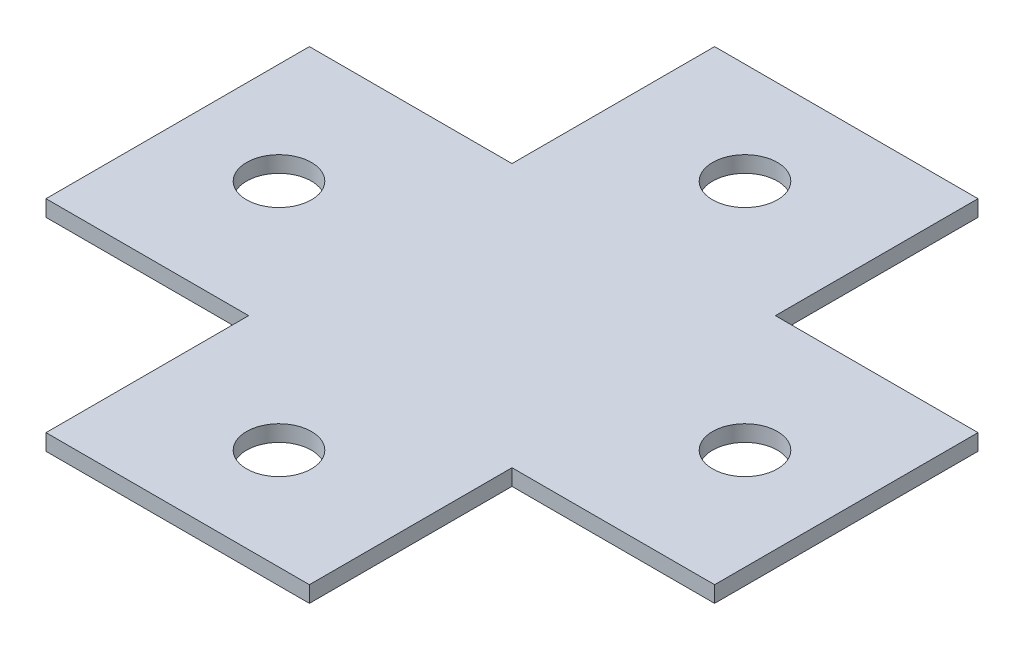
ISO-10303-21;
HEADER;
FILE_DESCRIPTION(('STEP AP214'),'2;1');
FILE_NAME('part.step','',(''),(''),'','','');
FILE_SCHEMA(('AUTOMOTIVE_DESIGN { 1 0 10303 214 1 1 1 1 }'));
ENDSEC;
DATA;
#1=APPLICATION_CONTEXT('core data for automotive mechanical design processes');
#2=APPLICATION_PROTOCOL_DEFINITION('international standard','automotive_design',2000,#1);
#3=PRODUCT_CONTEXT('',#1,'mechanical');
#4=PRODUCT('Part','Part','',(#3));
#5=PRODUCT_RELATED_PRODUCT_CATEGORY('part','',(#4));
#6=PRODUCT_DEFINITION_FORMATION('','',#4);
#7=PRODUCT_DEFINITION_CONTEXT('part definition',#1,'design');
#8=PRODUCT_DEFINITION('design','',#6,#7);
#9=PRODUCT_DEFINITION_SHAPE('','',#8);
#10=(LENGTH_UNIT() NAMED_UNIT(*) SI_UNIT(.MILLI.,.METRE.));
#11=(NAMED_UNIT(*) PLANE_ANGLE_UNIT() SI_UNIT($,.RADIAN.));
#12=(NAMED_UNIT(*) SI_UNIT($,.STERADIAN.) SOLID_ANGLE_UNIT());
#13=UNCERTAINTY_MEASURE_WITH_UNIT(LENGTH_MEASURE(1.E-05),#10,'distance_accuracy_value','');
#14=(GEOMETRIC_REPRESENTATION_CONTEXT(3) GLOBAL_UNCERTAINTY_ASSIGNED_CONTEXT((#13)) GLOBAL_UNIT_ASSIGNED_CONTEXT((#10,
#11,#12)) REPRESENTATION_CONTEXT('',''));
#15=CARTESIAN_POINT('',(0.,0.,0.));
#16=DIRECTION('',(0.,0.,1.));
#17=DIRECTION('',(1.,0.,0.));
#18=AXIS2_PLACEMENT_3D('',#15,#16,#17);
#19=CARTESIAN_POINT('',(0.,2.54,-20.6375));
#20=DIRECTION('',(0.,0.,-1.));
#21=DIRECTION('',(-1.,0.,0.));
#22=AXIS2_PLACEMENT_3D('',#19,#20,#21);
#23=PLANE('',#22);
#24=DIRECTION('',(1.,0.,0.));
#25=VECTOR('',#24,1.);
#26=CARTESIAN_POINT('',(0.,0.,-20.6375));
#27=LINE('',#26,#25);
#28=CARTESIAN_POINT('',(-52.3875,0.,-20.6375));
#29=VERTEX_POINT('',#28);
#30=CARTESIAN_POINT('',(-20.6375,0.,-20.6375));
#31=VERTEX_POINT('',#30);
#32=EDGE_CURVE('E160',#29,#31,#27,.T.);
#33=ORIENTED_EDGE('',*,*,#32,.F.);
#34=DIRECTION('',(0.,-1.,0.));
#35=VECTOR('',#34,1.);
#36=CARTESIAN_POINT('',(-52.3875,2.54,-20.6375));
#37=LINE('',#36,#35);
#38=CARTESIAN_POINT('',(-52.3875,2.54,-20.6375));
#39=VERTEX_POINT('',#38);
#40=EDGE_CURVE('E11',#39,#29,#37,.T.);
#41=ORIENTED_EDGE('',*,*,#40,.F.);
#42=DIRECTION('',(1.,0.,0.));
#43=VECTOR('',#42,1.);
#44=CARTESIAN_POINT('',(0.,2.54,-20.6375));
#45=LINE('',#44,#43);
#46=CARTESIAN_POINT('',(-20.6375,2.54,-20.6375));
#47=VERTEX_POINT('',#46);
#48=EDGE_CURVE('E202',#39,#47,#45,.T.);
#49=ORIENTED_EDGE('',*,*,#48,.T.);
#50=DIRECTION('',(0.,-1.,0.));
#51=VECTOR('',#50,1.);
#52=CARTESIAN_POINT('',(-20.6375,2.54,-20.6375));
#53=LINE('',#52,#51);
#54=EDGE_CURVE('E56',#47,#31,#53,.T.);
#55=ORIENTED_EDGE('',*,*,#54,.T.);
#56=EDGE_LOOP('',(#33,#41,#49,#55));
#57=FACE_BOUND('',#56,.T.);
#58=ADVANCED_FACE('F39',(#57),#23,.T.);
#59=CARTESIAN_POINT('',(-52.3875,2.54,0.));
#60=DIRECTION('',(-1.,0.,0.));
#61=DIRECTION('',(0.,0.,1.));
#62=AXIS2_PLACEMENT_3D('',#59,#60,#61);
#63=PLANE('',#62);
#64=DIRECTION('',(0.,0.,-1.));
#65=VECTOR('',#64,1.);
#66=CARTESIAN_POINT('',(-52.3875,0.,0.));
#67=LINE('',#66,#65);
#68=CARTESIAN_POINT('',(-52.3875,0.,20.6375));
#69=VERTEX_POINT('',#68);
#70=EDGE_CURVE('E163',#69,#29,#67,.T.);
#71=ORIENTED_EDGE('',*,*,#70,.F.);
#72=DIRECTION('',(0.,-1.,0.));
#73=VECTOR('',#72,1.);
#74=CARTESIAN_POINT('',(-52.3875,2.54,20.6375));
#75=LINE('',#74,#73);
#76=CARTESIAN_POINT('',(-52.3875,2.54,20.6375));
#77=VERTEX_POINT('',#76);
#78=EDGE_CURVE('E48',#77,#69,#75,.T.);
#79=ORIENTED_EDGE('',*,*,#78,.F.);
#80=DIRECTION('',(0.,0.,-1.));
#81=VECTOR('',#80,1.);
#82=CARTESIAN_POINT('',(-52.3875,2.54,0.));
#83=LINE('',#82,#81);
#84=EDGE_CURVE('E245',#77,#39,#83,.T.);
#85=ORIENTED_EDGE('',*,*,#84,.T.);
#86=ORIENTED_EDGE('',*,*,#40,.T.);
#87=EDGE_LOOP('',(#71,#79,#85,#86));
#88=FACE_BOUND('',#87,.T.);
#89=ADVANCED_FACE('F244',(#88),#63,.T.);
#90=CARTESIAN_POINT('',(0.,2.54,20.6375));
#91=DIRECTION('',(0.,0.,-1.));
#92=DIRECTION('',(-1.,0.,0.));
#93=AXIS2_PLACEMENT_3D('',#90,#91,#92);
#94=PLANE('',#93);
#95=DIRECTION('',(1.,0.,0.));
#96=VECTOR('',#95,1.);
#97=CARTESIAN_POINT('',(0.,0.,20.6375));
#98=LINE('',#97,#96);
#99=CARTESIAN_POINT('',(-20.6375,0.,20.6375));
#100=VERTEX_POINT('',#99);
#101=EDGE_CURVE('E168',#69,#100,#98,.T.);
#102=ORIENTED_EDGE('',*,*,#101,.T.);
#103=DIRECTION('',(0.,-1.,0.));
#104=VECTOR('',#103,1.);
#105=CARTESIAN_POINT('',(-20.6375,2.54,20.6375));
#106=LINE('',#105,#104);
#107=CARTESIAN_POINT('',(-20.6375,2.54,20.6375));
#108=VERTEX_POINT('',#107);
#109=EDGE_CURVE('E227',#108,#100,#106,.T.);
#110=ORIENTED_EDGE('',*,*,#109,.F.);
#111=DIRECTION('',(1.,0.,0.));
#112=VECTOR('',#111,1.);
#113=CARTESIAN_POINT('',(0.,2.54,20.6375));
#114=LINE('',#113,#112);
#115=EDGE_CURVE('E235',#77,#108,#114,.T.);
#116=ORIENTED_EDGE('',*,*,#115,.F.);
#117=ORIENTED_EDGE('',*,*,#78,.T.);
#118=EDGE_LOOP('',(#102,#110,#116,#117));
#119=FACE_BOUND('',#118,.T.);
#120=ADVANCED_FACE('F233',(#119),#94,.F.);
#121=CARTESIAN_POINT('',(-20.6375,2.54,0.));
#122=DIRECTION('',(-1.,0.,0.));
#123=DIRECTION('',(0.,0.,1.));
#124=AXIS2_PLACEMENT_3D('',#121,#122,#123);
#125=PLANE('',#124);
#126=DIRECTION('',(0.,0.,-1.));
#127=VECTOR('',#126,1.);
#128=CARTESIAN_POINT('',(-20.6375,0.,0.));
#129=LINE('',#128,#127);
#130=CARTESIAN_POINT('',(-20.6375,0.,52.3875));
#131=VERTEX_POINT('',#130);
#132=EDGE_CURVE('E172',#131,#100,#129,.T.);
#133=ORIENTED_EDGE('',*,*,#132,.F.);
#134=DIRECTION('',(0.,-1.,0.));
#135=VECTOR('',#134,1.);
#136=CARTESIAN_POINT('',(-20.6375,2.54,52.3875));
#137=LINE('',#136,#135);
#138=CARTESIAN_POINT('',(-20.6375,2.54,52.3875));
#139=VERTEX_POINT('',#138);
#140=EDGE_CURVE('E224',#139,#131,#137,.T.);
#141=ORIENTED_EDGE('',*,*,#140,.F.);
#142=DIRECTION('',(0.,0.,-1.));
#143=VECTOR('',#142,1.);
#144=CARTESIAN_POINT('',(-20.6375,2.54,0.));
#145=LINE('',#144,#143);
#146=EDGE_CURVE('E406',#139,#108,#145,.T.);
#147=ORIENTED_EDGE('',*,*,#146,.T.);
#148=ORIENTED_EDGE('',*,*,#109,.T.);
#149=EDGE_LOOP('',(#133,#141,#147,#148));
#150=FACE_BOUND('',#149,.T.);
#151=ADVANCED_FACE('F264',(#150),#125,.T.);
#152=CARTESIAN_POINT('',(0.,2.54,52.3875));
#153=DIRECTION('',(0.,0.,-1.));
#154=DIRECTION('',(-1.,0.,0.));
#155=AXIS2_PLACEMENT_3D('',#152,#153,#154);
#156=PLANE('',#155);
#157=DIRECTION('',(1.,0.,0.));
#158=VECTOR('',#157,1.);
#159=CARTESIAN_POINT('',(0.,0.,52.3875));
#160=LINE('',#159,#158);
#161=CARTESIAN_POINT('',(20.6375,0.,52.3875));
#162=VERTEX_POINT('',#161);
#163=EDGE_CURVE('E176',#131,#162,#160,.T.);
#164=ORIENTED_EDGE('',*,*,#163,.T.);
#165=DIRECTION('',(0.,-1.,0.));
#166=VECTOR('',#165,1.);
#167=CARTESIAN_POINT('',(20.6375,2.54,52.3875));
#168=LINE('',#167,#166);
#169=CARTESIAN_POINT('',(20.6375,2.54,52.3875));
#170=VERTEX_POINT('',#169);
#171=EDGE_CURVE('E220',#170,#162,#168,.T.);
#172=ORIENTED_EDGE('',*,*,#171,.F.);
#173=DIRECTION('',(1.,0.,0.));
#174=VECTOR('',#173,1.);
#175=CARTESIAN_POINT('',(0.,2.54,52.3875));
#176=LINE('',#175,#174);
#177=EDGE_CURVE('E410',#139,#170,#176,.T.);
#178=ORIENTED_EDGE('',*,*,#177,.F.);
#179=ORIENTED_EDGE('',*,*,#140,.T.);
#180=EDGE_LOOP('',(#164,#172,#178,#179));
#181=FACE_BOUND('',#180,.T.);
#182=ADVANCED_FACE('F269',(#181),#156,.F.);
#183=CARTESIAN_POINT('',(20.6375,2.54,0.));
#184=DIRECTION('',(-1.,0.,0.));
#185=DIRECTION('',(0.,0.,1.));
#186=AXIS2_PLACEMENT_3D('',#183,#184,#185);
#187=PLANE('',#186);
#188=DIRECTION('',(0.,0.,-1.));
#189=VECTOR('',#188,1.);
#190=CARTESIAN_POINT('',(20.6375,0.,0.));
#191=LINE('',#190,#189);
#192=CARTESIAN_POINT('',(20.6375,0.,20.6375));
#193=VERTEX_POINT('',#192);
#194=EDGE_CURVE('E179',#162,#193,#191,.T.);
#195=ORIENTED_EDGE('',*,*,#194,.T.);
#196=DIRECTION('',(0.,-1.,0.));
#197=VECTOR('',#196,1.);
#198=CARTESIAN_POINT('',(20.6375,2.54,20.6375));
#199=LINE('',#198,#197);
#200=CARTESIAN_POINT('',(20.6375,2.54,20.6375));
#201=VERTEX_POINT('',#200);
#202=EDGE_CURVE('E216',#201,#193,#199,.T.);
#203=ORIENTED_EDGE('',*,*,#202,.F.);
#204=DIRECTION('',(0.,0.,-1.));
#205=VECTOR('',#204,1.);
#206=CARTESIAN_POINT('',(20.6375,2.54,0.));
#207=LINE('',#206,#205);
#208=EDGE_CURVE('E413',#170,#201,#207,.T.);
#209=ORIENTED_EDGE('',*,*,#208,.F.);
#210=ORIENTED_EDGE('',*,*,#171,.T.);
#211=EDGE_LOOP('',(#195,#203,#209,#210));
#212=FACE_BOUND('',#211,.T.);
#213=ADVANCED_FACE('F273',(#212),#187,.F.);
#214=CARTESIAN_POINT('',(0.,2.54,20.6375));
#215=DIRECTION('',(0.,0.,-1.));
#216=DIRECTION('',(-1.,0.,0.));
#217=AXIS2_PLACEMENT_3D('',#214,#215,#216);
#218=PLANE('',#217);
#219=DIRECTION('',(1.,0.,0.));
#220=VECTOR('',#219,1.);
#221=CARTESIAN_POINT('',(0.,0.,20.6375));
#222=LINE('',#221,#220);
#223=CARTESIAN_POINT('',(52.3875,0.,20.6375));
#224=VERTEX_POINT('',#223);
#225=EDGE_CURVE('E182',#193,#224,#222,.T.);
#226=ORIENTED_EDGE('',*,*,#225,.T.);
#227=DIRECTION('',(0.,-1.,0.));
#228=VECTOR('',#227,1.);
#229=CARTESIAN_POINT('',(52.3875,2.54,20.6375));
#230=LINE('',#229,#228);
#231=CARTESIAN_POINT('',(52.3875,2.54,20.6375));
#232=VERTEX_POINT('',#231);
#233=EDGE_CURVE('E212',#232,#224,#230,.T.);
#234=ORIENTED_EDGE('',*,*,#233,.F.);
#235=DIRECTION('',(1.,0.,0.));
#236=VECTOR('',#235,1.);
#237=CARTESIAN_POINT('',(0.,2.54,20.6375));
#238=LINE('',#237,#236);
#239=EDGE_CURVE('E416',#201,#232,#238,.T.);
#240=ORIENTED_EDGE('',*,*,#239,.F.);
#241=ORIENTED_EDGE('',*,*,#202,.T.);
#242=EDGE_LOOP('',(#226,#234,#240,#241));
#243=FACE_BOUND('',#242,.T.);
#244=ADVANCED_FACE('F277',(#243),#218,.F.);
#245=CARTESIAN_POINT('',(52.3875,2.54,0.));
#246=DIRECTION('',(-1.,0.,0.));
#247=DIRECTION('',(0.,0.,1.));
#248=AXIS2_PLACEMENT_3D('',#245,#246,#247);
#249=PLANE('',#248);
#250=DIRECTION('',(0.,0.,-1.));
#251=VECTOR('',#250,1.);
#252=CARTESIAN_POINT('',(52.3875,0.,0.));
#253=LINE('',#252,#251);
#254=CARTESIAN_POINT('',(52.3875,0.,-20.6375));
#255=VERTEX_POINT('',#254);
#256=EDGE_CURVE('E185',#224,#255,#253,.T.);
#257=ORIENTED_EDGE('',*,*,#256,.T.);
#258=DIRECTION('',(0.,-1.,0.));
#259=VECTOR('',#258,1.);
#260=CARTESIAN_POINT('',(52.3875,2.54,-20.6375));
#261=LINE('',#260,#259);
#262=CARTESIAN_POINT('',(52.3875,2.54,-20.6375));
#263=VERTEX_POINT('',#262);
#264=EDGE_CURVE('E209',#263,#255,#261,.T.);
#265=ORIENTED_EDGE('',*,*,#264,.F.);
#266=DIRECTION('',(0.,0.,-1.));
#267=VECTOR('',#266,1.);
#268=CARTESIAN_POINT('',(52.3875,2.54,0.));
#269=LINE('',#268,#267);
#270=EDGE_CURVE('E419',#232,#263,#269,.T.);
#271=ORIENTED_EDGE('',*,*,#270,.F.);
#272=ORIENTED_EDGE('',*,*,#233,.T.);
#273=EDGE_LOOP('',(#257,#265,#271,#272));
#274=FACE_BOUND('',#273,.T.);
#275=ADVANCED_FACE('F281',(#274),#249,.F.);
#276=CARTESIAN_POINT('',(0.,2.54,-20.6375));
#277=DIRECTION('',(0.,0.,-1.));
#278=DIRECTION('',(-1.,0.,0.));
#279=AXIS2_PLACEMENT_3D('',#276,#277,#278);
#280=PLANE('',#279);
#281=DIRECTION('',(1.,0.,0.));
#282=VECTOR('',#281,1.);
#283=CARTESIAN_POINT('',(0.,0.,-20.6375));
#284=LINE('',#283,#282);
#285=CARTESIAN_POINT('',(20.6375,0.,-20.6375));
#286=VERTEX_POINT('',#285);
#287=EDGE_CURVE('E189',#286,#255,#284,.T.);
#288=ORIENTED_EDGE('',*,*,#287,.F.);
#289=DIRECTION('',(0.,-1.,0.));
#290=VECTOR('',#289,1.);
#291=CARTESIAN_POINT('',(20.6375,2.54,-20.6375));
#292=LINE('',#291,#290);
#293=CARTESIAN_POINT('',(20.6375,2.54,-20.6375));
#294=VERTEX_POINT('',#293);
#295=EDGE_CURVE('E150',#294,#286,#292,.T.);
#296=ORIENTED_EDGE('',*,*,#295,.F.);
#297=DIRECTION('',(1.,0.,0.));
#298=VECTOR('',#297,1.);
#299=CARTESIAN_POINT('',(0.,2.54,-20.6375));
#300=LINE('',#299,#298);
#301=EDGE_CURVE('E138',#294,#263,#300,.T.);
#302=ORIENTED_EDGE('',*,*,#301,.T.);
#303=ORIENTED_EDGE('',*,*,#264,.T.);
#304=EDGE_LOOP('',(#288,#296,#302,#303));
#305=FACE_BOUND('',#304,.T.);
#306=ADVANCED_FACE('F285',(#305),#280,.T.);
#307=CARTESIAN_POINT('',(20.6375,2.54,0.));
#308=DIRECTION('',(-1.,0.,0.));
#309=DIRECTION('',(0.,0.,1.));
#310=AXIS2_PLACEMENT_3D('',#307,#308,#309);
#311=PLANE('',#310);
#312=DIRECTION('',(0.,0.,-1.));
#313=VECTOR('',#312,1.);
#314=CARTESIAN_POINT('',(20.6375,0.,0.));
#315=LINE('',#314,#313);
#316=CARTESIAN_POINT('',(20.6375,0.,-52.3875));
#317=VERTEX_POINT('',#316);
#318=EDGE_CURVE('E146',#286,#317,#315,.T.);
#319=ORIENTED_EDGE('',*,*,#318,.T.);
#320=DIRECTION('',(0.,-1.,0.));
#321=VECTOR('',#320,1.);
#322=CARTESIAN_POINT('',(20.6375,2.54,-52.3875));
#323=LINE('',#322,#321);
#324=CARTESIAN_POINT('',(20.6375,2.54,-52.3875));
#325=VERTEX_POINT('',#324);
#326=EDGE_CURVE('E143',#325,#317,#323,.T.);
#327=ORIENTED_EDGE('',*,*,#326,.F.);
#328=DIRECTION('',(0.,0.,-1.));
#329=VECTOR('',#328,1.);
#330=CARTESIAN_POINT('',(20.6375,2.54,0.));
#331=LINE('',#330,#329);
#332=EDGE_CURVE('E131',#294,#325,#331,.T.);
#333=ORIENTED_EDGE('',*,*,#332,.F.);
#334=ORIENTED_EDGE('',*,*,#295,.T.);
#335=EDGE_LOOP('',(#319,#327,#333,#334));
#336=FACE_BOUND('',#335,.T.);
#337=ADVANCED_FACE('F144',(#336),#311,.F.);
#338=CARTESIAN_POINT('',(0.,2.54,-52.3875));
#339=DIRECTION('',(0.,0.,-1.));
#340=DIRECTION('',(-1.,0.,0.));
#341=AXIS2_PLACEMENT_3D('',#338,#339,#340);
#342=PLANE('',#341);
#343=DIRECTION('',(1.,0.,0.));
#344=VECTOR('',#343,1.);
#345=CARTESIAN_POINT('',(0.,0.,-52.3875));
#346=LINE('',#345,#344);
#347=CARTESIAN_POINT('',(-20.6375,0.,-52.3875));
#348=VERTEX_POINT('',#347);
#349=EDGE_CURVE('E195',#348,#317,#346,.T.);
#350=ORIENTED_EDGE('',*,*,#349,.F.);
#351=DIRECTION('',(0.,-1.,0.));
#352=VECTOR('',#351,1.);
#353=CARTESIAN_POINT('',(-20.6375,2.54,-52.3875));
#354=LINE('',#353,#352);
#355=CARTESIAN_POINT('',(-20.6375,2.54,-52.3875));
#356=VERTEX_POINT('',#355);
#357=EDGE_CURVE('E93',#356,#348,#354,.T.);
#358=ORIENTED_EDGE('',*,*,#357,.F.);
#359=DIRECTION('',(1.,0.,0.));
#360=VECTOR('',#359,1.);
#361=CARTESIAN_POINT('',(0.,2.54,-52.3875));
#362=LINE('',#361,#360);
#363=EDGE_CURVE('E136',#356,#325,#362,.T.);
#364=ORIENTED_EDGE('',*,*,#363,.T.);
#365=ORIENTED_EDGE('',*,*,#326,.T.);
#366=EDGE_LOOP('',(#350,#358,#364,#365));
#367=FACE_BOUND('',#366,.T.);
#368=ADVANCED_FACE('F152',(#367),#342,.T.);
#369=CARTESIAN_POINT('',(-20.6375,2.54,0.));
#370=DIRECTION('',(-1.,0.,0.));
#371=DIRECTION('',(0.,0.,1.));
#372=AXIS2_PLACEMENT_3D('',#369,#370,#371);
#373=PLANE('',#372);
#374=DIRECTION('',(0.,0.,-1.));
#375=VECTOR('',#374,1.);
#376=CARTESIAN_POINT('',(-20.6375,0.,0.));
#377=LINE('',#376,#375);
#378=EDGE_CURVE('E198',#31,#348,#377,.T.);
#379=ORIENTED_EDGE('',*,*,#378,.F.);
#380=ORIENTED_EDGE('',*,*,#54,.F.);
#381=DIRECTION('',(0.,0.,-1.));
#382=VECTOR('',#381,1.);
#383=CARTESIAN_POINT('',(-20.6375,2.54,0.));
#384=LINE('',#383,#382);
#385=EDGE_CURVE('E154',#47,#356,#384,.T.);
#386=ORIENTED_EDGE('',*,*,#385,.T.);
#387=ORIENTED_EDGE('',*,*,#357,.T.);
#388=EDGE_LOOP('',(#379,#380,#386,#387));
#389=FACE_BOUND('',#388,.T.);
#390=ADVANCED_FACE('F246',(#389),#373,.T.);
#391=CARTESIAN_POINT('',(0.,2.54,0.));
#392=DIRECTION('',(0.,1.,0.));
#393=DIRECTION('',(0.,0.,1.));
#394=AXIS2_PLACEMENT_3D('',#391,#392,#393);
#395=PLANE('',#394);
#396=CARTESIAN_POINT('',(0.,2.54,36.5125));
#397=DIRECTION('',(0.,1.,0.));
#398=DIRECTION('',(0.,0.,1.));
#399=AXIS2_PLACEMENT_3D('',#396,#397,#398);
#400=CIRCLE('',#399,5.08);
#401=CARTESIAN_POINT('',(0.,2.54,41.5925));
#402=VERTEX_POINT('',#401);
#403=EDGE_CURVE('E370',#402,#402,#400,.T.);
#404=ORIENTED_EDGE('',*,*,#403,.F.);
#405=EDGE_LOOP('',(#404));
#406=FACE_BOUND('',#405,.T.);
#407=CARTESIAN_POINT('',(-36.5125,2.54,-1.28369537222284E-13));
#408=DIRECTION('',(0.,1.,0.));
#409=DIRECTION('',(0.,0.,1.));
#410=AXIS2_PLACEMENT_3D('',#407,#408,#409);
#411=CIRCLE('',#410,5.08);
#412=CARTESIAN_POINT('',(-36.5125,2.54,5.07999999999988));
#413=VERTEX_POINT('',#412);
#414=EDGE_CURVE('E378',#413,#413,#411,.T.);
#415=ORIENTED_EDGE('',*,*,#414,.F.);
#416=EDGE_LOOP('',(#415));
#417=FACE_BOUND('',#416,.T.);
#418=CARTESIAN_POINT('',(2.56739074444567E-13,2.54,-36.5125));
#419=DIRECTION('',(0.,1.,0.));
#420=DIRECTION('',(0.,0.,1.));
#421=AXIS2_PLACEMENT_3D('',#418,#419,#420);
#422=CIRCLE('',#421,5.08);
#423=CARTESIAN_POINT('',(2.56739074444567E-13,2.54,-31.4325));
#424=VERTEX_POINT('',#423);
#425=EDGE_CURVE('E388',#424,#424,#422,.T.);
#426=ORIENTED_EDGE('',*,*,#425,.F.);
#427=EDGE_LOOP('',(#426));
#428=FACE_BOUND('',#427,.T.);
#429=CARTESIAN_POINT('',(36.5125,2.54,3.81639164714898E-13));
#430=DIRECTION('',(0.,1.,0.));
#431=DIRECTION('',(0.,0.,1.));
#432=AXIS2_PLACEMENT_3D('',#429,#430,#431);
#433=CIRCLE('',#432,5.08);
#434=CARTESIAN_POINT('',(36.5125,2.54,5.08000000000039));
#435=VERTEX_POINT('',#434);
#436=EDGE_CURVE('E396',#435,#435,#433,.T.);
#437=ORIENTED_EDGE('',*,*,#436,.F.);
#438=EDGE_LOOP('',(#437));
#439=FACE_BOUND('',#438,.T.);
#440=ORIENTED_EDGE('',*,*,#48,.F.);
#441=ORIENTED_EDGE('',*,*,#84,.F.);
#442=ORIENTED_EDGE('',*,*,#115,.T.);
#443=ORIENTED_EDGE('',*,*,#146,.F.);
#444=ORIENTED_EDGE('',*,*,#177,.T.);
#445=ORIENTED_EDGE('',*,*,#208,.T.);
#446=ORIENTED_EDGE('',*,*,#239,.T.);
#447=ORIENTED_EDGE('',*,*,#270,.T.);
#448=ORIENTED_EDGE('',*,*,#301,.F.);
#449=ORIENTED_EDGE('',*,*,#332,.T.);
#450=ORIENTED_EDGE('',*,*,#363,.F.);
#451=ORIENTED_EDGE('',*,*,#385,.F.);
#452=EDGE_LOOP('',(#440,#441,#442,#443,#444,#445,#446,#447,#448,#449,#450,#451));
#453=FACE_BOUND('',#452,.T.);
#454=ADVANCED_FACE('F133',(#406,#417,#428,#439,#453),#395,.T.);
#455=CARTESIAN_POINT('',(0.,0.,0.));
#456=DIRECTION('',(0.,1.,0.));
#457=DIRECTION('',(0.,0.,1.));
#458=AXIS2_PLACEMENT_3D('',#455,#456,#457);
#459=PLANE('',#458);
#460=CARTESIAN_POINT('',(0.,0.,36.5125));
#461=DIRECTION('',(0.,1.,0.));
#462=DIRECTION('',(0.,0.,1.));
#463=AXIS2_PLACEMENT_3D('',#460,#461,#462);
#464=CIRCLE('',#463,5.08);
#465=CARTESIAN_POINT('',(0.,0.,41.5925));
#466=VERTEX_POINT('',#465);
#467=EDGE_CURVE('E164',#466,#466,#464,.T.);
#468=ORIENTED_EDGE('',*,*,#467,.T.);
#469=EDGE_LOOP('',(#468));
#470=FACE_BOUND('',#469,.T.);
#471=CARTESIAN_POINT('',(-36.5125,0.,-1.28369537222284E-13));
#472=DIRECTION('',(0.,1.,0.));
#473=DIRECTION('',(0.,0.,1.));
#474=AXIS2_PLACEMENT_3D('',#471,#472,#473);
#475=CIRCLE('',#474,5.08);
#476=CARTESIAN_POINT('',(-36.5125,0.,5.07999999999988));
#477=VERTEX_POINT('',#476);
#478=EDGE_CURVE('E372',#477,#477,#475,.T.);
#479=ORIENTED_EDGE('',*,*,#478,.T.);
#480=EDGE_LOOP('',(#479));
#481=FACE_BOUND('',#480,.T.);
#482=CARTESIAN_POINT('',(2.56739074444567E-13,0.,-36.5125));
#483=DIRECTION('',(0.,1.,0.));
#484=DIRECTION('',(0.,0.,1.));
#485=AXIS2_PLACEMENT_3D('',#482,#483,#484);
#486=CIRCLE('',#485,5.08);
#487=CARTESIAN_POINT('',(2.56739074444567E-13,0.,-31.4325));
#488=VERTEX_POINT('',#487);
#489=EDGE_CURVE('E384',#488,#488,#486,.T.);
#490=ORIENTED_EDGE('',*,*,#489,.T.);
#491=EDGE_LOOP('',(#490));
#492=FACE_BOUND('',#491,.T.);
#493=CARTESIAN_POINT('',(36.5125,0.,3.81639164714898E-13));
#494=DIRECTION('',(0.,1.,0.));
#495=DIRECTION('',(0.,0.,1.));
#496=AXIS2_PLACEMENT_3D('',#493,#494,#495);
#497=CIRCLE('',#496,5.08);
#498=CARTESIAN_POINT('',(36.5125,0.,5.08000000000039));
#499=VERTEX_POINT('',#498);
#500=EDGE_CURVE('E392',#499,#499,#497,.T.);
#501=ORIENTED_EDGE('',*,*,#500,.T.);
#502=EDGE_LOOP('',(#501));
#503=FACE_BOUND('',#502,.T.);
#504=ORIENTED_EDGE('',*,*,#32,.T.);
#505=ORIENTED_EDGE('',*,*,#378,.T.);
#506=ORIENTED_EDGE('',*,*,#349,.T.);
#507=ORIENTED_EDGE('',*,*,#318,.F.);
#508=ORIENTED_EDGE('',*,*,#287,.T.);
#509=ORIENTED_EDGE('',*,*,#256,.F.);
#510=ORIENTED_EDGE('',*,*,#225,.F.);
#511=ORIENTED_EDGE('',*,*,#194,.F.);
#512=ORIENTED_EDGE('',*,*,#163,.F.);
#513=ORIENTED_EDGE('',*,*,#132,.T.);
#514=ORIENTED_EDGE('',*,*,#101,.F.);
#515=ORIENTED_EDGE('',*,*,#70,.T.);
#516=EDGE_LOOP('',(#504,#505,#506,#507,#508,#509,#510,#511,#512,#513,#514,#515));
#517=FACE_BOUND('',#516,.T.);
#518=ADVANCED_FACE('F241',(#470,#481,#492,#503,#517),#459,.F.);
#519=CARTESIAN_POINT('',(36.5125,0.,3.81639164714898E-13));
#520=DIRECTION('',(0.,1.,0.));
#521=DIRECTION('',(0.,0.,1.));
#522=AXIS2_PLACEMENT_3D('',#519,#520,#521);
#523=CYLINDRICAL_SURFACE('',#522,5.08);
#524=ORIENTED_EDGE('',*,*,#500,.F.);
#525=EDGE_LOOP('',(#524));
#526=FACE_BOUND('',#525,.T.);
#527=ORIENTED_EDGE('',*,*,#436,.T.);
#528=EDGE_LOOP('',(#527));
#529=FACE_BOUND('',#528,.T.);
#530=ADVANCED_FACE('F321',(#526,#529),#523,.F.);
#531=CARTESIAN_POINT('',(2.56739074444567E-13,0.,-36.5125));
#532=DIRECTION('',(0.,1.,0.));
#533=DIRECTION('',(0.,0.,1.));
#534=AXIS2_PLACEMENT_3D('',#531,#532,#533);
#535=CYLINDRICAL_SURFACE('',#534,5.08);
#536=ORIENTED_EDGE('',*,*,#489,.F.);
#537=EDGE_LOOP('',(#536));
#538=FACE_BOUND('',#537,.T.);
#539=ORIENTED_EDGE('',*,*,#425,.T.);
#540=EDGE_LOOP('',(#539));
#541=FACE_BOUND('',#540,.T.);
#542=ADVANCED_FACE('F331',(#538,#541),#535,.F.);
#543=CARTESIAN_POINT('',(-36.5125,0.,-1.28369537222284E-13));
#544=DIRECTION('',(0.,1.,0.));
#545=DIRECTION('',(0.,0.,1.));
#546=AXIS2_PLACEMENT_3D('',#543,#544,#545);
#547=CYLINDRICAL_SURFACE('',#546,5.08);
#548=ORIENTED_EDGE('',*,*,#478,.F.);
#549=EDGE_LOOP('',(#548));
#550=FACE_BOUND('',#549,.T.);
#551=ORIENTED_EDGE('',*,*,#414,.T.);
#552=EDGE_LOOP('',(#551));
#553=FACE_BOUND('',#552,.T.);
#554=ADVANCED_FACE('F341',(#550,#553),#547,.F.);
#555=CARTESIAN_POINT('',(0.,0.,36.5125));
#556=DIRECTION('',(0.,1.,0.));
#557=DIRECTION('',(0.,0.,1.));
#558=AXIS2_PLACEMENT_3D('',#555,#556,#557);
#559=CYLINDRICAL_SURFACE('',#558,5.08);
#560=ORIENTED_EDGE('',*,*,#467,.F.);
#561=EDGE_LOOP('',(#560));
#562=FACE_BOUND('',#561,.T.);
#563=ORIENTED_EDGE('',*,*,#403,.T.);
#564=EDGE_LOOP('',(#563));
#565=FACE_BOUND('',#564,.T.);
#566=ADVANCED_FACE('F351',(#562,#565),#559,.F.);
#567=CLOSED_SHELL('',(#58,#89,#120,#151,#182,#213,#244,#275,#306,#337,#368,#390,#454,#518,#530,
#542,#554,#566));
#568=MANIFOLD_SOLID_BREP('B2',#567);
#569=ADVANCED_BREP_SHAPE_REPRESENTATION('',(#18,#568),#14);
#570=SHAPE_DEFINITION_REPRESENTATION(#9,#569);
ENDSEC;
END-ISO-10303-21;
